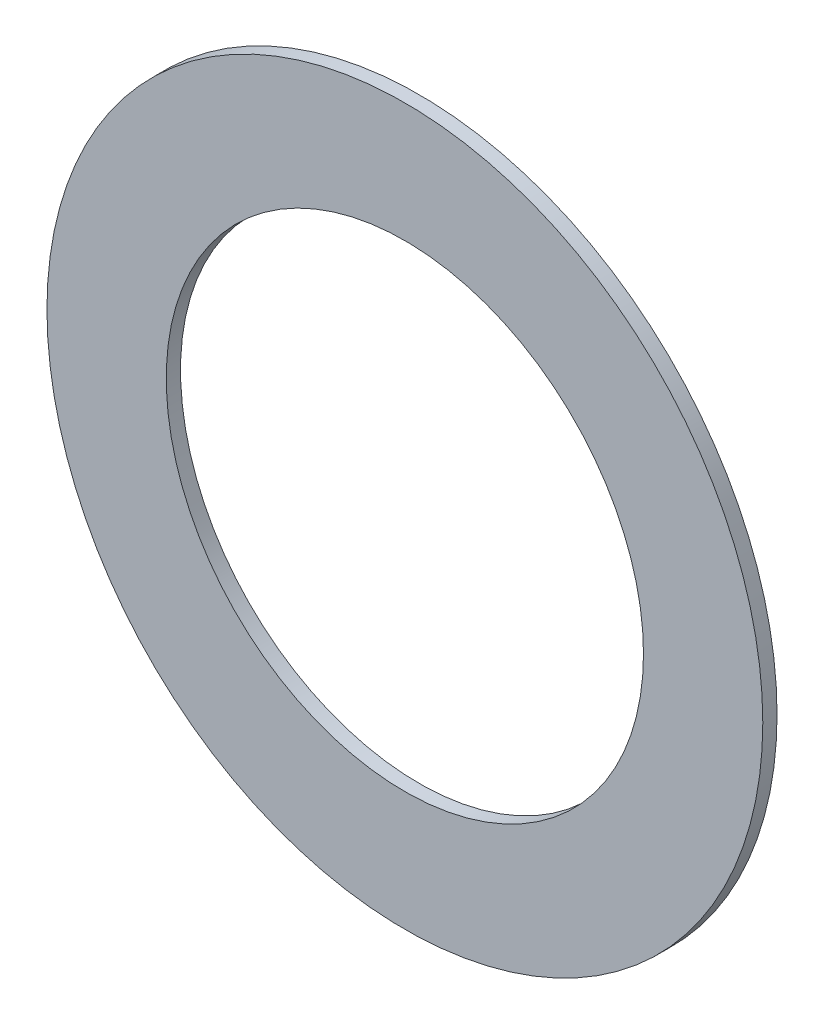
ISO-10303-21;
HEADER;
FILE_DESCRIPTION(('STEP AP214'),'2;1');
FILE_NAME('part.step','',(''),(''),'','','');
FILE_SCHEMA(('AUTOMOTIVE_DESIGN { 1 0 10303 214 1 1 1 1 }'));
ENDSEC;
DATA;
#1=APPLICATION_CONTEXT('core data for automotive mechanical design processes');
#2=APPLICATION_PROTOCOL_DEFINITION('international standard','automotive_design',2000,#1);
#3=PRODUCT_CONTEXT('',#1,'mechanical');
#4=PRODUCT('Part','Part','',(#3));
#5=PRODUCT_RELATED_PRODUCT_CATEGORY('part','',(#4));
#6=PRODUCT_DEFINITION_FORMATION('','',#4);
#7=PRODUCT_DEFINITION_CONTEXT('part definition',#1,'design');
#8=PRODUCT_DEFINITION('design','',#6,#7);
#9=PRODUCT_DEFINITION_SHAPE('','',#8);
#10=(LENGTH_UNIT() NAMED_UNIT(*) SI_UNIT(.MILLI.,.METRE.));
#11=(NAMED_UNIT(*) PLANE_ANGLE_UNIT() SI_UNIT($,.RADIAN.));
#12=(NAMED_UNIT(*) SI_UNIT($,.STERADIAN.) SOLID_ANGLE_UNIT());
#13=UNCERTAINTY_MEASURE_WITH_UNIT(LENGTH_MEASURE(1.E-05),#10,'distance_accuracy_value','');
#14=(GEOMETRIC_REPRESENTATION_CONTEXT(3) GLOBAL_UNCERTAINTY_ASSIGNED_CONTEXT((#13)) GLOBAL_UNIT_ASSIGNED_CONTEXT((#10,
#11,#12)) REPRESENTATION_CONTEXT('',''));
#15=CARTESIAN_POINT('',(0.,0.,0.));
#16=DIRECTION('',(0.,0.,1.));
#17=DIRECTION('',(1.,0.,0.));
#18=AXIS2_PLACEMENT_3D('',#15,#16,#17);
#19=CARTESIAN_POINT('',(0.,0.,0.));
#20=DIRECTION('',(0.,0.,-1.));
#21=DIRECTION('',(1.,0.,0.));
#22=AXIS2_PLACEMENT_3D('',#19,#20,#21);
#23=CYLINDRICAL_SURFACE('',#22,0.89250012);
#24=CARTESIAN_POINT('',(0.,0.,0.03556));
#25=DIRECTION('',(0.,0.,1.));
#26=DIRECTION('',(1.,0.,0.));
#27=AXIS2_PLACEMENT_3D('',#24,#25,#26);
#28=CIRCLE('',#27,0.89250012);
#29=CARTESIAN_POINT('',(0.89250012,0.,0.03556));
#30=VERTEX_POINT('',#29);
#31=EDGE_CURVE('E11',#30,#30,#28,.T.);
#32=ORIENTED_EDGE('',*,*,#31,.F.);
#33=DIRECTION('',(0.,0.,1.));
#34=VECTOR('',#33,1.);
#35=CARTESIAN_POINT('',(0.89250012,0.,0.));
#36=LINE('',#35,#34);
#37=CARTESIAN_POINT('',(0.89250012,0.,0.));
#38=VERTEX_POINT('',#37);
#39=EDGE_CURVE('E24',#38,#30,#36,.T.);
#40=ORIENTED_EDGE('',*,*,#39,.F.);
#41=CARTESIAN_POINT('',(0.,0.,0.));
#42=DIRECTION('',(0.,0.,1.));
#43=DIRECTION('',(1.,0.,0.));
#44=AXIS2_PLACEMENT_3D('',#41,#42,#43);
#45=CIRCLE('',#44,0.89250012);
#46=EDGE_CURVE('E46',#38,#38,#45,.T.);
#47=ORIENTED_EDGE('',*,*,#46,.T.);
#48=ORIENTED_EDGE('',*,*,#39,.T.);
#49=EDGE_LOOP('',(#32,#40,#47,#48));
#50=FACE_BOUND('',#49,.T.);
#51=ADVANCED_FACE('F17',(#50),#23,.T.);
#52=CARTESIAN_POINT('',(0.,0.,0.));
#53=DIRECTION('',(0.,0.,-1.));
#54=DIRECTION('',(1.,0.,0.));
#55=AXIS2_PLACEMENT_3D('',#52,#53,#54);
#56=CYLINDRICAL_SURFACE('',#55,0.59500008);
#57=DIRECTION('',(0.,0.,1.));
#58=VECTOR('',#57,1.);
#59=CARTESIAN_POINT('',(0.59500008,0.,0.));
#60=LINE('',#59,#58);
#61=CARTESIAN_POINT('',(0.59500008,0.,0.));
#62=VERTEX_POINT('',#61);
#63=CARTESIAN_POINT('',(0.59500008,0.,0.03556));
#64=VERTEX_POINT('',#63);
#65=EDGE_CURVE('E40',#62,#64,#60,.T.);
#66=ORIENTED_EDGE('',*,*,#65,.T.);
#67=CARTESIAN_POINT('',(0.,0.,0.03556));
#68=DIRECTION('',(0.,0.,1.));
#69=DIRECTION('',(1.,0.,0.));
#70=AXIS2_PLACEMENT_3D('',#67,#68,#69);
#71=CIRCLE('',#70,0.59500008);
#72=EDGE_CURVE('E45',#64,#64,#71,.T.);
#73=ORIENTED_EDGE('',*,*,#72,.T.);
#74=ORIENTED_EDGE('',*,*,#65,.F.);
#75=CARTESIAN_POINT('',(0.,0.,0.));
#76=DIRECTION('',(0.,0.,1.));
#77=DIRECTION('',(1.,0.,0.));
#78=AXIS2_PLACEMENT_3D('',#75,#76,#77);
#79=CIRCLE('',#78,0.59500008);
#80=EDGE_CURVE('E43',#62,#62,#79,.T.);
#81=ORIENTED_EDGE('',*,*,#80,.F.);
#82=EDGE_LOOP('',(#66,#73,#74,#81));
#83=FACE_BOUND('',#82,.T.);
#84=ADVANCED_FACE('F42',(#83),#56,.F.);
#85=CARTESIAN_POINT('',(0.89250012,0.,0.));
#86=DIRECTION('',(0.,0.,-1.));
#87=DIRECTION('',(-1.,0.,0.));
#88=AXIS2_PLACEMENT_3D('',#85,#86,#87);
#89=PLANE('',#88);
#90=ORIENTED_EDGE('',*,*,#46,.F.);
#91=EDGE_LOOP('',(#90));
#92=FACE_BOUND('',#91,.T.);
#93=ORIENTED_EDGE('',*,*,#80,.T.);
#94=EDGE_LOOP('',(#93));
#95=FACE_BOUND('',#94,.T.);
#96=ADVANCED_FACE('F49',(#92,#95),#89,.T.);
#97=CARTESIAN_POINT('',(0.89250012,0.,0.03556));
#98=DIRECTION('',(0.,0.,-1.));
#99=DIRECTION('',(-1.,0.,0.));
#100=AXIS2_PLACEMENT_3D('',#97,#98,#99);
#101=PLANE('',#100);
#102=ORIENTED_EDGE('',*,*,#31,.T.);
#103=EDGE_LOOP('',(#102));
#104=FACE_BOUND('',#103,.T.);
#105=ORIENTED_EDGE('',*,*,#72,.F.);
#106=EDGE_LOOP('',(#105));
#107=FACE_BOUND('',#106,.T.);
#108=ADVANCED_FACE('F56',(#104,#107),#101,.F.);
#109=CLOSED_SHELL('',(#51,#84,#96,#108));
#110=MANIFOLD_SOLID_BREP('B1',#109);
#111=ADVANCED_BREP_SHAPE_REPRESENTATION('',(#18,#110),#14);
#112=SHAPE_DEFINITION_REPRESENTATION(#9,#111);
ENDSEC;
END-ISO-10303-21;
